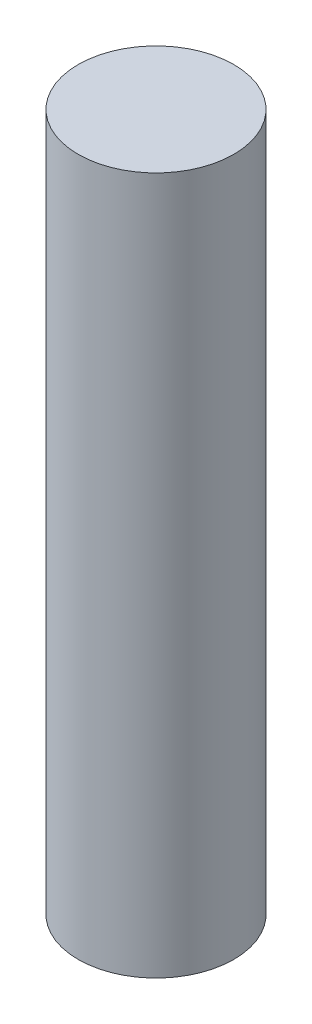
ISO-10303-21;
HEADER;
FILE_DESCRIPTION(('STEP AP214'),'2;1');
FILE_NAME('part.step','',(''),(''),'','','');
FILE_SCHEMA(('AUTOMOTIVE_DESIGN { 1 0 10303 214 1 1 1 1 }'));
ENDSEC;
DATA;
#1=APPLICATION_CONTEXT('core data for automotive mechanical design processes');
#2=APPLICATION_PROTOCOL_DEFINITION('international standard','automotive_design',2000,#1);
#3=PRODUCT_CONTEXT('',#1,'mechanical');
#4=PRODUCT('Part','Part','',(#3));
#5=PRODUCT_RELATED_PRODUCT_CATEGORY('part','',(#4));
#6=PRODUCT_DEFINITION_FORMATION('','',#4);
#7=PRODUCT_DEFINITION_CONTEXT('part definition',#1,'design');
#8=PRODUCT_DEFINITION('design','',#6,#7);
#9=PRODUCT_DEFINITION_SHAPE('','',#8);
#10=(LENGTH_UNIT() NAMED_UNIT(*) SI_UNIT(.MILLI.,.METRE.));
#11=(NAMED_UNIT(*) PLANE_ANGLE_UNIT() SI_UNIT($,.RADIAN.));
#12=(NAMED_UNIT(*) SI_UNIT($,.STERADIAN.) SOLID_ANGLE_UNIT());
#13=UNCERTAINTY_MEASURE_WITH_UNIT(LENGTH_MEASURE(1.E-05),#10,'distance_accuracy_value','');
#14=(GEOMETRIC_REPRESENTATION_CONTEXT(3) GLOBAL_UNCERTAINTY_ASSIGNED_CONTEXT((#13)) GLOBAL_UNIT_ASSIGNED_CONTEXT((#10,
#11,#12)) REPRESENTATION_CONTEXT('',''));
#15=CARTESIAN_POINT('',(0.,0.,0.));
#16=DIRECTION('',(0.,0.,1.));
#17=DIRECTION('',(1.,0.,0.));
#18=AXIS2_PLACEMENT_3D('',#15,#16,#17);
#19=CARTESIAN_POINT('',(0.,10.,0.));
#20=DIRECTION('',(0.,-1.,0.));
#21=DIRECTION('',(0.,0.,-1.));
#22=AXIS2_PLACEMENT_3D('',#19,#20,#21);
#23=CYLINDRICAL_SURFACE('',#22,1.11602540378444);
#24=CARTESIAN_POINT('',(0.,10.,0.));
#25=DIRECTION('',(0.,1.,0.));
#26=DIRECTION('',(0.,0.,1.));
#27=AXIS2_PLACEMENT_3D('',#24,#25,#26);
#28=CIRCLE('',#27,1.11602540378444);
#29=CARTESIAN_POINT('',(0.,10.,1.11602540378444));
#30=VERTEX_POINT('',#29);
#31=EDGE_CURVE('E10',#30,#30,#28,.T.);
#32=ORIENTED_EDGE('',*,*,#31,.F.);
#33=EDGE_LOOP('',(#32));
#34=FACE_BOUND('',#33,.T.);
#35=CARTESIAN_POINT('',(0.,0.,0.));
#36=DIRECTION('',(0.,1.,0.));
#37=DIRECTION('',(0.,0.,1.));
#38=AXIS2_PLACEMENT_3D('',#35,#36,#37);
#39=CIRCLE('',#38,1.11602540378444);
#40=CARTESIAN_POINT('',(0.,0.,1.11602540378444));
#41=VERTEX_POINT('',#40);
#42=EDGE_CURVE('E46',#41,#41,#39,.T.);
#43=ORIENTED_EDGE('',*,*,#42,.T.);
#44=EDGE_LOOP('',(#43));
#45=FACE_BOUND('',#44,.T.);
#46=ADVANCED_FACE('F43',(#34,#45),#23,.T.);
#47=CARTESIAN_POINT('',(0.,10.,0.));
#48=DIRECTION('',(0.,1.,0.));
#49=DIRECTION('',(0.,0.,1.));
#50=AXIS2_PLACEMENT_3D('',#47,#48,#49);
#51=PLANE('',#50);
#52=ORIENTED_EDGE('',*,*,#31,.T.);
#53=EDGE_LOOP('',(#52));
#54=FACE_BOUND('',#53,.T.);
#55=ADVANCED_FACE('F60',(#54),#51,.T.);
#56=CARTESIAN_POINT('',(0.,0.,0.));
#57=DIRECTION('',(0.,1.,0.));
#58=DIRECTION('',(0.,0.,1.));
#59=AXIS2_PLACEMENT_3D('',#56,#57,#58);
#60=PLANE('',#59);
#61=ORIENTED_EDGE('',*,*,#42,.F.);
#62=EDGE_LOOP('',(#61));
#63=FACE_BOUND('',#62,.T.);
#64=ADVANCED_FACE('F58',(#63),#60,.F.);
#65=CLOSED_SHELL('',(#46,#55,#64));
#66=MANIFOLD_SOLID_BREP('B2',#65);
#67=ADVANCED_BREP_SHAPE_REPRESENTATION('',(#18,#66),#14);
#68=SHAPE_DEFINITION_REPRESENTATION(#9,#67);
ENDSEC;
END-ISO-10303-21;
